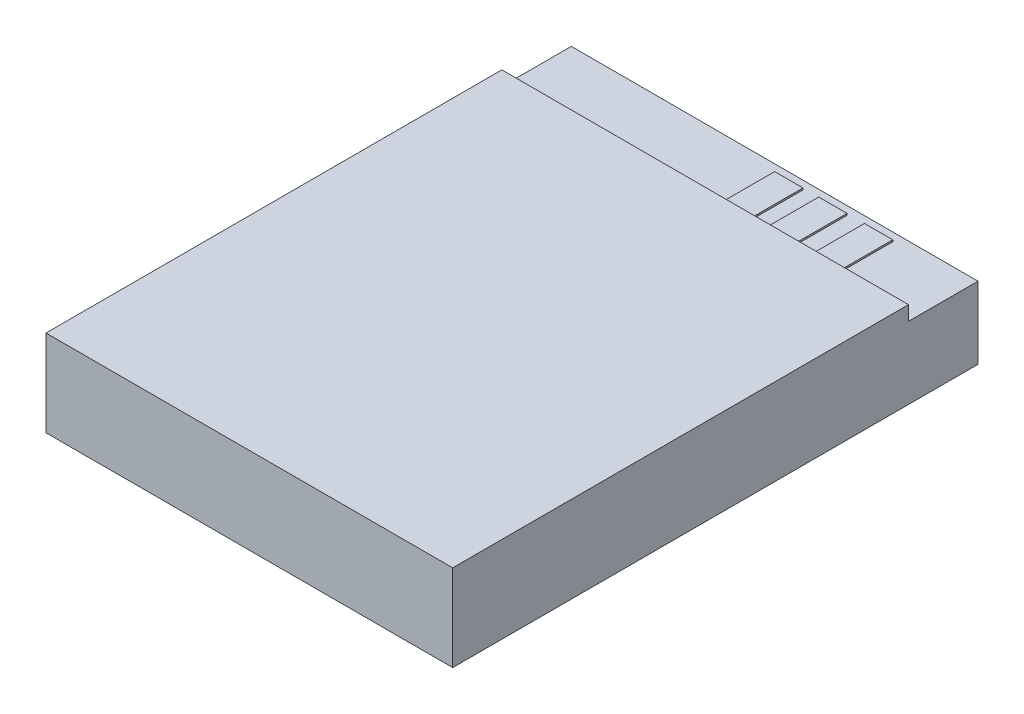
ISO-10303-21;
HEADER;
FILE_DESCRIPTION(('STEP AP214'),'2;1');
FILE_NAME('part.step','',(''),(''),'','','');
FILE_SCHEMA(('AUTOMOTIVE_DESIGN { 1 0 10303 214 1 1 1 1 }'));
ENDSEC;
DATA;
#1=APPLICATION_CONTEXT('core data for automotive mechanical design processes');
#2=APPLICATION_PROTOCOL_DEFINITION('international standard','automotive_design',2000,#1);
#3=PRODUCT_CONTEXT('',#1,'mechanical');
#4=PRODUCT('Part','Part','',(#3));
#5=PRODUCT_RELATED_PRODUCT_CATEGORY('part','',(#4));
#6=PRODUCT_DEFINITION_FORMATION('','',#4);
#7=PRODUCT_DEFINITION_CONTEXT('part definition',#1,'design');
#8=PRODUCT_DEFINITION('design','',#6,#7);
#9=PRODUCT_DEFINITION_SHAPE('','',#8);
#10=(LENGTH_UNIT() NAMED_UNIT(*) SI_UNIT(.MILLI.,.METRE.));
#11=(NAMED_UNIT(*) PLANE_ANGLE_UNIT() SI_UNIT($,.RADIAN.));
#12=(NAMED_UNIT(*) SI_UNIT($,.STERADIAN.) SOLID_ANGLE_UNIT());
#13=UNCERTAINTY_MEASURE_WITH_UNIT(LENGTH_MEASURE(1.E-05),#10,'distance_accuracy_value','');
#14=(GEOMETRIC_REPRESENTATION_CONTEXT(3) GLOBAL_UNCERTAINTY_ASSIGNED_CONTEXT((#13)) GLOBAL_UNIT_ASSIGNED_CONTEXT((#10,
#11,#12)) REPRESENTATION_CONTEXT('',''));
#15=CARTESIAN_POINT('',(0.,0.,0.));
#16=DIRECTION('',(0.,0.,1.));
#17=DIRECTION('',(1.,0.,0.));
#18=AXIS2_PLACEMENT_3D('',#15,#16,#17);
#19=CARTESIAN_POINT('',(0.,4.25,0.));
#20=DIRECTION('',(0.,1.,0.));
#21=DIRECTION('',(0.,0.,1.));
#22=AXIS2_PLACEMENT_3D('',#19,#20,#21);
#23=PLANE('',#22);
#24=DIRECTION('',(0.,0.,1.));
#25=VECTOR('',#24,1.);
#26=CARTESIAN_POINT('',(-12.,4.25,-15.5));
#27=LINE('',#26,#25);
#28=CARTESIAN_POINT('',(-12.,4.25,-15.5));
#29=VERTEX_POINT('',#28);
#30=CARTESIAN_POINT('',(-12.,4.25,-11.4));
#31=VERTEX_POINT('',#30);
#32=EDGE_CURVE('E248',#29,#31,#27,.T.);
#33=ORIENTED_EDGE('',*,*,#32,.T.);
#34=DIRECTION('',(1.,0.,0.));
#35=VECTOR('',#34,1.);
#36=CARTESIAN_POINT('',(-12.,4.25,-11.4));
#37=LINE('',#36,#35);
#38=CARTESIAN_POINT('',(12.,4.25,-11.4));
#39=VERTEX_POINT('',#38);
#40=EDGE_CURVE('E251',#31,#39,#37,.T.);
#41=ORIENTED_EDGE('',*,*,#40,.T.);
#42=DIRECTION('',(0.,0.,1.));
#43=VECTOR('',#42,1.);
#44=CARTESIAN_POINT('',(12.,4.25,-15.5));
#45=LINE('',#44,#43);
#46=CARTESIAN_POINT('',(12.,4.25,-15.5));
#47=VERTEX_POINT('',#46);
#48=EDGE_CURVE('E254',#47,#39,#45,.T.);
#49=ORIENTED_EDGE('',*,*,#48,.F.);
#50=DIRECTION('',(1.,0.,0.));
#51=VECTOR('',#50,1.);
#52=CARTESIAN_POINT('',(-12.,4.25,-15.5));
#53=LINE('',#52,#51);
#54=EDGE_CURVE('E257',#29,#47,#53,.T.);
#55=ORIENTED_EDGE('',*,*,#54,.F.);
#56=EDGE_LOOP('',(#33,#41,#49,#55));
#57=FACE_BOUND('',#56,.T.);
#58=DIRECTION('',(1.,0.,0.));
#59=VECTOR('',#58,1.);
#60=CARTESIAN_POINT('',(0.500000000000003,4.25,-12.));
#61=LINE('',#60,#59);
#62=CARTESIAN_POINT('',(0.500000000000003,4.25,-12.));
#63=VERTEX_POINT('',#62);
#64=CARTESIAN_POINT('',(2.17,4.25,-12.));
#65=VERTEX_POINT('',#64);
#66=EDGE_CURVE('E232',#63,#65,#61,.T.);
#67=ORIENTED_EDGE('',*,*,#66,.F.);
#68=DIRECTION('',(0.,0.,1.));
#69=VECTOR('',#68,1.);
#70=CARTESIAN_POINT('',(0.500000000000002,4.25,-15.));
#71=LINE('',#70,#69);
#72=CARTESIAN_POINT('',(0.500000000000002,4.25,-15.));
#73=VERTEX_POINT('',#72);
#74=EDGE_CURVE('E218',#73,#63,#71,.T.);
#75=ORIENTED_EDGE('',*,*,#74,.F.);
#76=DIRECTION('',(-1.,0.,0.));
#77=VECTOR('',#76,1.);
#78=CARTESIAN_POINT('',(0.500000000000002,4.25,-15.));
#79=LINE('',#78,#77);
#80=CARTESIAN_POINT('',(2.17,4.25,-15.));
#81=VERTEX_POINT('',#80);
#82=EDGE_CURVE('E223',#81,#73,#79,.T.);
#83=ORIENTED_EDGE('',*,*,#82,.F.);
#84=DIRECTION('',(0.,0.,-1.));
#85=VECTOR('',#84,1.);
#86=CARTESIAN_POINT('',(2.17,4.25,-15.));
#87=LINE('',#86,#85);
#88=EDGE_CURVE('E234',#65,#81,#87,.T.);
#89=ORIENTED_EDGE('',*,*,#88,.F.);
#90=EDGE_LOOP('',(#67,#75,#83,#89));
#91=FACE_BOUND('',#90,.T.);
#92=DIRECTION('',(1.,0.,0.));
#93=VECTOR('',#92,1.);
#94=CARTESIAN_POINT('',(3.1,4.25,-12.));
#95=LINE('',#94,#93);
#96=CARTESIAN_POINT('',(3.1,4.25,-12.));
#97=VERTEX_POINT('',#96);
#98=CARTESIAN_POINT('',(4.77,4.25,-12.));
#99=VERTEX_POINT('',#98);
#100=EDGE_CURVE('E190',#97,#99,#95,.T.);
#101=ORIENTED_EDGE('',*,*,#100,.F.);
#102=DIRECTION('',(0.,0.,1.));
#103=VECTOR('',#102,1.);
#104=CARTESIAN_POINT('',(3.1,4.25,-15.));
#105=LINE('',#104,#103);
#106=CARTESIAN_POINT('',(3.1,4.25,-15.));
#107=VERTEX_POINT('',#106);
#108=EDGE_CURVE('E187',#107,#97,#105,.T.);
#109=ORIENTED_EDGE('',*,*,#108,.F.);
#110=DIRECTION('',(-1.,0.,0.));
#111=VECTOR('',#110,1.);
#112=CARTESIAN_POINT('',(3.1,4.25,-15.));
#113=LINE('',#112,#111);
#114=CARTESIAN_POINT('',(4.77,4.25,-15.));
#115=VERTEX_POINT('',#114);
#116=EDGE_CURVE('E199',#115,#107,#113,.T.);
#117=ORIENTED_EDGE('',*,*,#116,.F.);
#118=DIRECTION('',(0.,0.,-1.));
#119=VECTOR('',#118,1.);
#120=CARTESIAN_POINT('',(4.77,4.25,-15.));
#121=LINE('',#120,#119);
#122=EDGE_CURVE('E207',#99,#115,#121,.T.);
#123=ORIENTED_EDGE('',*,*,#122,.F.);
#124=EDGE_LOOP('',(#101,#109,#117,#123));
#125=FACE_BOUND('',#124,.T.);
#126=DIRECTION('',(1.,0.,0.));
#127=VECTOR('',#126,1.);
#128=CARTESIAN_POINT('',(5.8,4.25,-12.));
#129=LINE('',#128,#127);
#130=CARTESIAN_POINT('',(5.8,4.25,-12.));
#131=VERTEX_POINT('',#130);
#132=CARTESIAN_POINT('',(7.47,4.25,-12.));
#133=VERTEX_POINT('',#132);
#134=EDGE_CURVE('E328',#131,#133,#129,.T.);
#135=ORIENTED_EDGE('',*,*,#134,.F.);
#136=DIRECTION('',(0.,0.,1.));
#137=VECTOR('',#136,1.);
#138=CARTESIAN_POINT('',(5.8,4.25,-15.));
#139=LINE('',#138,#137);
#140=CARTESIAN_POINT('',(5.8,4.25,-15.));
#141=VERTEX_POINT('',#140);
#142=EDGE_CURVE('E185',#141,#131,#139,.T.);
#143=ORIENTED_EDGE('',*,*,#142,.F.);
#144=DIRECTION('',(-1.,0.,0.));
#145=VECTOR('',#144,1.);
#146=CARTESIAN_POINT('',(5.8,4.25,-15.));
#147=LINE('',#146,#145);
#148=CARTESIAN_POINT('',(7.47,4.25,-15.));
#149=VERTEX_POINT('',#148);
#150=EDGE_CURVE('E181',#149,#141,#147,.T.);
#151=ORIENTED_EDGE('',*,*,#150,.F.);
#152=DIRECTION('',(0.,0.,-1.));
#153=VECTOR('',#152,1.);
#154=CARTESIAN_POINT('',(7.47,4.25,-15.));
#155=LINE('',#154,#153);
#156=EDGE_CURVE('E330',#133,#149,#155,.T.);
#157=ORIENTED_EDGE('',*,*,#156,.F.);
#158=EDGE_LOOP('',(#135,#143,#151,#157));
#159=FACE_BOUND('',#158,.T.);
#160=ADVANCED_FACE('F37',(#57,#91,#125,#159),#23,.T.);
#161=CARTESIAN_POINT('',(-12.,5.1,-15.5));
#162=DIRECTION('',(0.,0.,1.));
#163=DIRECTION('',(1.,0.,0.));
#164=AXIS2_PLACEMENT_3D('',#161,#162,#163);
#165=PLANE('',#164);
#166=ORIENTED_EDGE('',*,*,#54,.T.);
#167=DIRECTION('',(0.,-1.,0.));
#168=VECTOR('',#167,1.);
#169=CARTESIAN_POINT('',(12.,5.1,-15.5));
#170=LINE('',#169,#168);
#171=CARTESIAN_POINT('',(12.,0.,-15.5));
#172=VERTEX_POINT('',#171);
#173=EDGE_CURVE('E11',#47,#172,#170,.T.);
#174=ORIENTED_EDGE('',*,*,#173,.T.);
#175=DIRECTION('',(-1.,0.,0.));
#176=VECTOR('',#175,1.);
#177=CARTESIAN_POINT('',(-12.,0.,-15.5));
#178=LINE('',#177,#176);
#179=CARTESIAN_POINT('',(-12.,0.,-15.5));
#180=VERTEX_POINT('',#179);
#181=EDGE_CURVE('E278',#172,#180,#178,.T.);
#182=ORIENTED_EDGE('',*,*,#181,.T.);
#183=DIRECTION('',(0.,-1.,0.));
#184=VECTOR('',#183,1.);
#185=CARTESIAN_POINT('',(-12.,5.1,-15.5));
#186=LINE('',#185,#184);
#187=EDGE_CURVE('E45',#29,#180,#186,.T.);
#188=ORIENTED_EDGE('',*,*,#187,.F.);
#189=EDGE_LOOP('',(#166,#174,#182,#188));
#190=FACE_BOUND('',#189,.T.);
#191=ADVANCED_FACE('F298',(#190),#165,.F.);
#192=CARTESIAN_POINT('',(12.,5.1,15.5));
#193=DIRECTION('',(-1.,0.,0.));
#194=DIRECTION('',(0.,0.,1.));
#195=AXIS2_PLACEMENT_3D('',#192,#193,#194);
#196=PLANE('',#195);
#197=ORIENTED_EDGE('',*,*,#48,.T.);
#198=DIRECTION('',(0.,1.,0.));
#199=VECTOR('',#198,1.);
#200=CARTESIAN_POINT('',(12.,4.25,-11.4));
#201=LINE('',#200,#199);
#202=CARTESIAN_POINT('',(12.,5.1,-11.4));
#203=VERTEX_POINT('',#202);
#204=EDGE_CURVE('E262',#39,#203,#201,.T.);
#205=ORIENTED_EDGE('',*,*,#204,.T.);
#206=DIRECTION('',(0.,0.,-1.));
#207=VECTOR('',#206,1.);
#208=CARTESIAN_POINT('',(12.,5.1,15.5));
#209=LINE('',#208,#207);
#210=CARTESIAN_POINT('',(12.,5.1,15.5));
#211=VERTEX_POINT('',#210);
#212=EDGE_CURVE('E267',#211,#203,#209,.T.);
#213=ORIENTED_EDGE('',*,*,#212,.F.);
#214=DIRECTION('',(0.,-1.,0.));
#215=VECTOR('',#214,1.);
#216=CARTESIAN_POINT('',(12.,5.1,15.5));
#217=LINE('',#216,#215);
#218=CARTESIAN_POINT('',(12.,0.,15.5));
#219=VERTEX_POINT('',#218);
#220=EDGE_CURVE('E275',#211,#219,#217,.T.);
#221=ORIENTED_EDGE('',*,*,#220,.T.);
#222=DIRECTION('',(0.,0.,-1.));
#223=VECTOR('',#222,1.);
#224=CARTESIAN_POINT('',(12.,0.,15.5));
#225=LINE('',#224,#223);
#226=EDGE_CURVE('E265',#219,#172,#225,.T.);
#227=ORIENTED_EDGE('',*,*,#226,.T.);
#228=ORIENTED_EDGE('',*,*,#173,.F.);
#229=EDGE_LOOP('',(#197,#205,#213,#221,#227,#228));
#230=FACE_BOUND('',#229,.T.);
#231=ADVANCED_FACE('F39',(#230),#196,.F.);
#232=CARTESIAN_POINT('',(-12.,5.1,15.5));
#233=DIRECTION('',(1.,0.,0.));
#234=DIRECTION('',(0.,0.,-1.));
#235=AXIS2_PLACEMENT_3D('',#232,#233,#234);
#236=PLANE('',#235);
#237=DIRECTION('',(0.,0.,1.));
#238=VECTOR('',#237,1.);
#239=CARTESIAN_POINT('',(-12.,5.1,15.5));
#240=LINE('',#239,#238);
#241=CARTESIAN_POINT('',(-12.,5.1,-11.4));
#242=VERTEX_POINT('',#241);
#243=CARTESIAN_POINT('',(-12.,5.1,15.5));
#244=VERTEX_POINT('',#243);
#245=EDGE_CURVE('E270',#242,#244,#240,.T.);
#246=ORIENTED_EDGE('',*,*,#245,.F.);
#247=DIRECTION('',(0.,1.,0.));
#248=VECTOR('',#247,1.);
#249=CARTESIAN_POINT('',(-12.,4.25,-11.4));
#250=LINE('',#249,#248);
#251=EDGE_CURVE('E260',#31,#242,#250,.T.);
#252=ORIENTED_EDGE('',*,*,#251,.F.);
#253=ORIENTED_EDGE('',*,*,#32,.F.);
#254=ORIENTED_EDGE('',*,*,#187,.T.);
#255=DIRECTION('',(0.,0.,1.));
#256=VECTOR('',#255,1.);
#257=CARTESIAN_POINT('',(-12.,0.,15.5));
#258=LINE('',#257,#256);
#259=CARTESIAN_POINT('',(-12.,0.,15.5));
#260=VERTEX_POINT('',#259);
#261=EDGE_CURVE('E281',#180,#260,#258,.T.);
#262=ORIENTED_EDGE('',*,*,#261,.T.);
#263=DIRECTION('',(0.,-1.,0.));
#264=VECTOR('',#263,1.);
#265=CARTESIAN_POINT('',(-12.,5.1,15.5));
#266=LINE('',#265,#264);
#267=EDGE_CURVE('E286',#244,#260,#266,.T.);
#268=ORIENTED_EDGE('',*,*,#267,.F.);
#269=EDGE_LOOP('',(#246,#252,#253,#254,#262,#268));
#270=FACE_BOUND('',#269,.T.);
#271=ADVANCED_FACE('F292',(#270),#236,.F.);
#272=CARTESIAN_POINT('',(-12.,5.1,15.5));
#273=DIRECTION('',(0.,0.,-1.));
#274=DIRECTION('',(-1.,0.,0.));
#275=AXIS2_PLACEMENT_3D('',#272,#273,#274);
#276=PLANE('',#275);
#277=DIRECTION('',(1.,0.,0.));
#278=VECTOR('',#277,1.);
#279=CARTESIAN_POINT('',(-12.,0.,15.5));
#280=LINE('',#279,#278);
#281=EDGE_CURVE('E271',#260,#219,#280,.T.);
#282=ORIENTED_EDGE('',*,*,#281,.T.);
#283=ORIENTED_EDGE('',*,*,#220,.F.);
#284=DIRECTION('',(1.,0.,0.));
#285=VECTOR('',#284,1.);
#286=CARTESIAN_POINT('',(-12.,5.1,15.5));
#287=LINE('',#286,#285);
#288=EDGE_CURVE('E273',#244,#211,#287,.T.);
#289=ORIENTED_EDGE('',*,*,#288,.F.);
#290=ORIENTED_EDGE('',*,*,#267,.T.);
#291=EDGE_LOOP('',(#282,#283,#289,#290));
#292=FACE_BOUND('',#291,.T.);
#293=ADVANCED_FACE('F306',(#292),#276,.F.);
#294=CARTESIAN_POINT('',(0.,5.1,0.));
#295=DIRECTION('',(0.,-1.,0.));
#296=DIRECTION('',(0.,0.,-1.));
#297=AXIS2_PLACEMENT_3D('',#294,#295,#296);
#298=PLANE('',#297);
#299=ORIENTED_EDGE('',*,*,#212,.T.);
#300=DIRECTION('',(1.,0.,0.));
#301=VECTOR('',#300,1.);
#302=CARTESIAN_POINT('',(-12.,5.1,-11.4));
#303=LINE('',#302,#301);
#304=EDGE_CURVE('E247',#242,#203,#303,.T.);
#305=ORIENTED_EDGE('',*,*,#304,.F.);
#306=ORIENTED_EDGE('',*,*,#245,.T.);
#307=ORIENTED_EDGE('',*,*,#288,.T.);
#308=EDGE_LOOP('',(#299,#305,#306,#307));
#309=FACE_BOUND('',#308,.T.);
#310=ADVANCED_FACE('F312',(#309),#298,.F.);
#311=CARTESIAN_POINT('',(0.,0.,0.));
#312=DIRECTION('',(0.,-1.,0.));
#313=DIRECTION('',(0.,0.,-1.));
#314=AXIS2_PLACEMENT_3D('',#311,#312,#313);
#315=PLANE('',#314);
#316=ORIENTED_EDGE('',*,*,#226,.F.);
#317=ORIENTED_EDGE('',*,*,#281,.F.);
#318=ORIENTED_EDGE('',*,*,#261,.F.);
#319=ORIENTED_EDGE('',*,*,#181,.F.);
#320=EDGE_LOOP('',(#316,#317,#318,#319));
#321=FACE_BOUND('',#320,.T.);
#322=ADVANCED_FACE('F303',(#321),#315,.T.);
#323=CARTESIAN_POINT('',(-12.,4.25,-11.4));
#324=DIRECTION('',(0.,0.,1.));
#325=DIRECTION('',(1.,0.,0.));
#326=AXIS2_PLACEMENT_3D('',#323,#324,#325);
#327=PLANE('',#326);
#328=ORIENTED_EDGE('',*,*,#304,.T.);
#329=ORIENTED_EDGE('',*,*,#204,.F.);
#330=ORIENTED_EDGE('',*,*,#40,.F.);
#331=ORIENTED_EDGE('',*,*,#251,.T.);
#332=EDGE_LOOP('',(#328,#329,#330,#331));
#333=FACE_BOUND('',#332,.T.);
#334=ADVANCED_FACE('F314',(#333),#327,.F.);
#335=CARTESIAN_POINT('',(0.500000000000002,4.35,-15.));
#336=DIRECTION('',(1.,0.,0.));
#337=DIRECTION('',(0.,0.,-1.));
#338=AXIS2_PLACEMENT_3D('',#335,#336,#337);
#339=PLANE('',#338);
#340=ORIENTED_EDGE('',*,*,#74,.T.);
#341=DIRECTION('',(0.,-1.,0.));
#342=VECTOR('',#341,1.);
#343=CARTESIAN_POINT('',(0.500000000000003,4.35,-12.));
#344=LINE('',#343,#342);
#345=CARTESIAN_POINT('',(0.500000000000003,4.35,-12.));
#346=VERTEX_POINT('',#345);
#347=EDGE_CURVE('E245',#346,#63,#344,.T.);
#348=ORIENTED_EDGE('',*,*,#347,.F.);
#349=DIRECTION('',(0.,0.,1.));
#350=VECTOR('',#349,1.);
#351=CARTESIAN_POINT('',(0.500000000000002,4.35,-15.));
#352=LINE('',#351,#350);
#353=CARTESIAN_POINT('',(0.500000000000002,4.35,-15.));
#354=VERTEX_POINT('',#353);
#355=EDGE_CURVE('E219',#354,#346,#352,.T.);
#356=ORIENTED_EDGE('',*,*,#355,.F.);
#357=DIRECTION('',(0.,-1.,0.));
#358=VECTOR('',#357,1.);
#359=CARTESIAN_POINT('',(0.500000000000002,4.35,-15.));
#360=LINE('',#359,#358);
#361=EDGE_CURVE('E229',#354,#73,#360,.T.);
#362=ORIENTED_EDGE('',*,*,#361,.T.);
#363=EDGE_LOOP('',(#340,#348,#356,#362));
#364=FACE_BOUND('',#363,.T.);
#365=ADVANCED_FACE('F389',(#364),#339,.F.);
#366=CARTESIAN_POINT('',(0.500000000000003,4.35,-12.));
#367=DIRECTION('',(0.,0.,-1.));
#368=DIRECTION('',(-1.,0.,0.));
#369=AXIS2_PLACEMENT_3D('',#366,#367,#368);
#370=PLANE('',#369);
#371=ORIENTED_EDGE('',*,*,#66,.T.);
#372=DIRECTION('',(0.,-1.,0.));
#373=VECTOR('',#372,1.);
#374=CARTESIAN_POINT('',(2.17,4.35,-12.));
#375=LINE('',#374,#373);
#376=CARTESIAN_POINT('',(2.17,4.35,-12.));
#377=VERTEX_POINT('',#376);
#378=EDGE_CURVE('E242',#377,#65,#375,.T.);
#379=ORIENTED_EDGE('',*,*,#378,.F.);
#380=DIRECTION('',(1.,0.,0.));
#381=VECTOR('',#380,1.);
#382=CARTESIAN_POINT('',(0.500000000000003,4.35,-12.));
#383=LINE('',#382,#381);
#384=EDGE_CURVE('E222',#346,#377,#383,.T.);
#385=ORIENTED_EDGE('',*,*,#384,.F.);
#386=ORIENTED_EDGE('',*,*,#347,.T.);
#387=EDGE_LOOP('',(#371,#379,#385,#386));
#388=FACE_BOUND('',#387,.T.);
#389=ADVANCED_FACE('F385',(#388),#370,.F.);
#390=CARTESIAN_POINT('',(2.17,4.35,-15.));
#391=DIRECTION('',(-1.,0.,0.));
#392=DIRECTION('',(0.,0.,1.));
#393=AXIS2_PLACEMENT_3D('',#390,#391,#392);
#394=PLANE('',#393);
#395=ORIENTED_EDGE('',*,*,#88,.T.);
#396=DIRECTION('',(0.,-1.,0.));
#397=VECTOR('',#396,1.);
#398=CARTESIAN_POINT('',(2.17,4.35,-15.));
#399=LINE('',#398,#397);
#400=CARTESIAN_POINT('',(2.17,4.35,-15.));
#401=VERTEX_POINT('',#400);
#402=EDGE_CURVE('E240',#401,#81,#399,.T.);
#403=ORIENTED_EDGE('',*,*,#402,.F.);
#404=DIRECTION('',(0.,0.,-1.));
#405=VECTOR('',#404,1.);
#406=CARTESIAN_POINT('',(2.17,4.35,-15.));
#407=LINE('',#406,#405);
#408=EDGE_CURVE('E225',#377,#401,#407,.T.);
#409=ORIENTED_EDGE('',*,*,#408,.F.);
#410=ORIENTED_EDGE('',*,*,#378,.T.);
#411=EDGE_LOOP('',(#395,#403,#409,#410));
#412=FACE_BOUND('',#411,.T.);
#413=ADVANCED_FACE('F381',(#412),#394,.F.);
#414=CARTESIAN_POINT('',(0.500000000000002,4.35,-15.));
#415=DIRECTION('',(0.,0.,1.));
#416=DIRECTION('',(1.,0.,0.));
#417=AXIS2_PLACEMENT_3D('',#414,#415,#416);
#418=PLANE('',#417);
#419=ORIENTED_EDGE('',*,*,#82,.T.);
#420=ORIENTED_EDGE('',*,*,#361,.F.);
#421=DIRECTION('',(-1.,0.,0.));
#422=VECTOR('',#421,1.);
#423=CARTESIAN_POINT('',(0.500000000000002,4.35,-15.));
#424=LINE('',#423,#422);
#425=EDGE_CURVE('E227',#401,#354,#424,.T.);
#426=ORIENTED_EDGE('',*,*,#425,.F.);
#427=ORIENTED_EDGE('',*,*,#402,.T.);
#428=EDGE_LOOP('',(#419,#420,#426,#427));
#429=FACE_BOUND('',#428,.T.);
#430=ADVANCED_FACE('F377',(#429),#418,.F.);
#431=CARTESIAN_POINT('',(0.,4.35,0.));
#432=DIRECTION('',(0.,1.,0.));
#433=DIRECTION('',(0.,0.,1.));
#434=AXIS2_PLACEMENT_3D('',#431,#432,#433);
#435=PLANE('',#434);
#436=ORIENTED_EDGE('',*,*,#355,.T.);
#437=ORIENTED_EDGE('',*,*,#384,.T.);
#438=ORIENTED_EDGE('',*,*,#408,.T.);
#439=ORIENTED_EDGE('',*,*,#425,.T.);
#440=EDGE_LOOP('',(#436,#437,#438,#439));
#441=FACE_BOUND('',#440,.T.);
#442=ADVANCED_FACE('F373',(#441),#435,.T.);
#443=CARTESIAN_POINT('',(3.1,4.35,-15.));
#444=DIRECTION('',(1.,0.,0.));
#445=DIRECTION('',(0.,0.,-1.));
#446=AXIS2_PLACEMENT_3D('',#443,#444,#445);
#447=PLANE('',#446);
#448=ORIENTED_EDGE('',*,*,#108,.T.);
#449=DIRECTION('',(0.,-1.,0.));
#450=VECTOR('',#449,1.);
#451=CARTESIAN_POINT('',(3.1,4.35,-12.));
#452=LINE('',#451,#450);
#453=CARTESIAN_POINT('',(3.1,4.35,-12.));
#454=VERTEX_POINT('',#453);
#455=EDGE_CURVE('E216',#454,#97,#452,.T.);
#456=ORIENTED_EDGE('',*,*,#455,.F.);
#457=DIRECTION('',(0.,0.,1.));
#458=VECTOR('',#457,1.);
#459=CARTESIAN_POINT('',(3.1,4.35,-15.));
#460=LINE('',#459,#458);
#461=CARTESIAN_POINT('',(3.1,4.35,-15.));
#462=VERTEX_POINT('',#461);
#463=EDGE_CURVE('E195',#462,#454,#460,.T.);
#464=ORIENTED_EDGE('',*,*,#463,.F.);
#465=DIRECTION('',(0.,-1.,0.));
#466=VECTOR('',#465,1.);
#467=CARTESIAN_POINT('',(3.1,4.35,-15.));
#468=LINE('',#467,#466);
#469=EDGE_CURVE('E204',#462,#107,#468,.T.);
#470=ORIENTED_EDGE('',*,*,#469,.T.);
#471=EDGE_LOOP('',(#448,#456,#464,#470));
#472=FACE_BOUND('',#471,.T.);
#473=ADVANCED_FACE('F369',(#472),#447,.F.);
#474=CARTESIAN_POINT('',(3.1,4.35,-12.));
#475=DIRECTION('',(0.,0.,-1.));
#476=DIRECTION('',(-1.,0.,0.));
#477=AXIS2_PLACEMENT_3D('',#474,#475,#476);
#478=PLANE('',#477);
#479=ORIENTED_EDGE('',*,*,#100,.T.);
#480=DIRECTION('',(0.,-1.,0.));
#481=VECTOR('',#480,1.);
#482=CARTESIAN_POINT('',(4.77,4.35,-12.));
#483=LINE('',#482,#481);
#484=CARTESIAN_POINT('',(4.77,4.35,-12.));
#485=VERTEX_POINT('',#484);
#486=EDGE_CURVE('E213',#485,#99,#483,.T.);
#487=ORIENTED_EDGE('',*,*,#486,.F.);
#488=DIRECTION('',(1.,0.,0.));
#489=VECTOR('',#488,1.);
#490=CARTESIAN_POINT('',(3.1,4.35,-12.));
#491=LINE('',#490,#489);
#492=EDGE_CURVE('E198',#454,#485,#491,.T.);
#493=ORIENTED_EDGE('',*,*,#492,.F.);
#494=ORIENTED_EDGE('',*,*,#455,.T.);
#495=EDGE_LOOP('',(#479,#487,#493,#494));
#496=FACE_BOUND('',#495,.T.);
#497=ADVANCED_FACE('F365',(#496),#478,.F.);
#498=CARTESIAN_POINT('',(4.77,4.35,-15.));
#499=DIRECTION('',(-1.,0.,0.));
#500=DIRECTION('',(0.,0.,1.));
#501=AXIS2_PLACEMENT_3D('',#498,#499,#500);
#502=PLANE('',#501);
#503=ORIENTED_EDGE('',*,*,#122,.T.);
#504=DIRECTION('',(0.,-1.,0.));
#505=VECTOR('',#504,1.);
#506=CARTESIAN_POINT('',(4.77,4.35,-15.));
#507=LINE('',#506,#505);
#508=CARTESIAN_POINT('',(4.77,4.35,-15.));
#509=VERTEX_POINT('',#508);
#510=EDGE_CURVE('E60',#509,#115,#507,.T.);
#511=ORIENTED_EDGE('',*,*,#510,.F.);
#512=DIRECTION('',(0.,0.,-1.));
#513=VECTOR('',#512,1.);
#514=CARTESIAN_POINT('',(4.77,4.35,-15.));
#515=LINE('',#514,#513);
#516=EDGE_CURVE('E201',#485,#509,#515,.T.);
#517=ORIENTED_EDGE('',*,*,#516,.F.);
#518=ORIENTED_EDGE('',*,*,#486,.T.);
#519=EDGE_LOOP('',(#503,#511,#517,#518));
#520=FACE_BOUND('',#519,.T.);
#521=ADVANCED_FACE('F362',(#520),#502,.F.);
#522=CARTESIAN_POINT('',(3.1,4.35,-15.));
#523=DIRECTION('',(0.,0.,1.));
#524=DIRECTION('',(1.,0.,0.));
#525=AXIS2_PLACEMENT_3D('',#522,#523,#524);
#526=PLANE('',#525);
#527=ORIENTED_EDGE('',*,*,#116,.T.);
#528=ORIENTED_EDGE('',*,*,#469,.F.);
#529=DIRECTION('',(-1.,0.,0.));
#530=VECTOR('',#529,1.);
#531=CARTESIAN_POINT('',(3.1,4.35,-15.));
#532=LINE('',#531,#530);
#533=EDGE_CURVE('E203',#509,#462,#532,.T.);
#534=ORIENTED_EDGE('',*,*,#533,.F.);
#535=ORIENTED_EDGE('',*,*,#510,.T.);
#536=EDGE_LOOP('',(#527,#528,#534,#535));
#537=FACE_BOUND('',#536,.T.);
#538=ADVANCED_FACE('F358',(#537),#526,.F.);
#539=CARTESIAN_POINT('',(0.,4.35,0.));
#540=DIRECTION('',(0.,1.,0.));
#541=DIRECTION('',(0.,0.,1.));
#542=AXIS2_PLACEMENT_3D('',#539,#540,#541);
#543=PLANE('',#542);
#544=ORIENTED_EDGE('',*,*,#463,.T.);
#545=ORIENTED_EDGE('',*,*,#492,.T.);
#546=ORIENTED_EDGE('',*,*,#516,.T.);
#547=ORIENTED_EDGE('',*,*,#533,.T.);
#548=EDGE_LOOP('',(#544,#545,#546,#547));
#549=FACE_BOUND('',#548,.T.);
#550=ADVANCED_FACE('F355',(#549),#543,.T.);
#551=CARTESIAN_POINT('',(5.8,4.35,-15.));
#552=DIRECTION('',(1.,0.,0.));
#553=DIRECTION('',(0.,0.,-1.));
#554=AXIS2_PLACEMENT_3D('',#551,#552,#553);
#555=PLANE('',#554);
#556=ORIENTED_EDGE('',*,*,#142,.T.);
#557=DIRECTION('',(0.,-1.,0.));
#558=VECTOR('',#557,1.);
#559=CARTESIAN_POINT('',(5.8,4.35,-12.));
#560=LINE('',#559,#558);
#561=CARTESIAN_POINT('',(5.8,4.35,-12.));
#562=VERTEX_POINT('',#561);
#563=EDGE_CURVE('E166',#562,#131,#560,.T.);
#564=ORIENTED_EDGE('',*,*,#563,.F.);
#565=DIRECTION('',(0.,0.,1.));
#566=VECTOR('',#565,1.);
#567=CARTESIAN_POINT('',(5.8,4.35,-15.));
#568=LINE('',#567,#566);
#569=CARTESIAN_POINT('',(5.8,4.35,-15.));
#570=VERTEX_POINT('',#569);
#571=EDGE_CURVE('E173',#570,#562,#568,.T.);
#572=ORIENTED_EDGE('',*,*,#571,.F.);
#573=DIRECTION('',(0.,-1.,0.));
#574=VECTOR('',#573,1.);
#575=CARTESIAN_POINT('',(5.8,4.35,-15.));
#576=LINE('',#575,#574);
#577=EDGE_CURVE('E337',#570,#141,#576,.T.);
#578=ORIENTED_EDGE('',*,*,#577,.T.);
#579=EDGE_LOOP('',(#556,#564,#572,#578));
#580=FACE_BOUND('',#579,.T.);
#581=ADVANCED_FACE('F183',(#580),#555,.F.);
#582=CARTESIAN_POINT('',(5.8,4.35,-12.));
#583=DIRECTION('',(0.,0.,-1.));
#584=DIRECTION('',(-1.,0.,0.));
#585=AXIS2_PLACEMENT_3D('',#582,#583,#584);
#586=PLANE('',#585);
#587=ORIENTED_EDGE('',*,*,#134,.T.);
#588=DIRECTION('',(0.,-1.,0.));
#589=VECTOR('',#588,1.);
#590=CARTESIAN_POINT('',(7.47,4.35,-12.));
#591=LINE('',#590,#589);
#592=CARTESIAN_POINT('',(7.47,4.35,-12.));
#593=VERTEX_POINT('',#592);
#594=EDGE_CURVE('E169',#593,#133,#591,.T.);
#595=ORIENTED_EDGE('',*,*,#594,.F.);
#596=DIRECTION('',(1.,0.,0.));
#597=VECTOR('',#596,1.);
#598=CARTESIAN_POINT('',(5.8,4.35,-12.));
#599=LINE('',#598,#597);
#600=EDGE_CURVE('E162',#562,#593,#599,.T.);
#601=ORIENTED_EDGE('',*,*,#600,.F.);
#602=ORIENTED_EDGE('',*,*,#563,.T.);
#603=EDGE_LOOP('',(#587,#595,#601,#602));
#604=FACE_BOUND('',#603,.T.);
#605=ADVANCED_FACE('F164',(#604),#586,.F.);
#606=CARTESIAN_POINT('',(7.47,4.35,-15.));
#607=DIRECTION('',(-1.,0.,0.));
#608=DIRECTION('',(0.,0.,1.));
#609=AXIS2_PLACEMENT_3D('',#606,#607,#608);
#610=PLANE('',#609);
#611=ORIENTED_EDGE('',*,*,#156,.T.);
#612=DIRECTION('',(0.,-1.,0.));
#613=VECTOR('',#612,1.);
#614=CARTESIAN_POINT('',(7.47,4.35,-15.));
#615=LINE('',#614,#613);
#616=CARTESIAN_POINT('',(7.47,4.35,-15.));
#617=VERTEX_POINT('',#616);
#618=EDGE_CURVE('E52',#617,#149,#615,.T.);
#619=ORIENTED_EDGE('',*,*,#618,.F.);
#620=DIRECTION('',(0.,0.,-1.));
#621=VECTOR('',#620,1.);
#622=CARTESIAN_POINT('',(7.47,4.35,-15.));
#623=LINE('',#622,#621);
#624=EDGE_CURVE('E172',#593,#617,#623,.T.);
#625=ORIENTED_EDGE('',*,*,#624,.F.);
#626=ORIENTED_EDGE('',*,*,#594,.T.);
#627=EDGE_LOOP('',(#611,#619,#625,#626));
#628=FACE_BOUND('',#627,.T.);
#629=ADVANCED_FACE('F340',(#628),#610,.F.);
#630=CARTESIAN_POINT('',(5.8,4.35,-15.));
#631=DIRECTION('',(0.,0.,1.));
#632=DIRECTION('',(1.,0.,0.));
#633=AXIS2_PLACEMENT_3D('',#630,#631,#632);
#634=PLANE('',#633);
#635=ORIENTED_EDGE('',*,*,#150,.T.);
#636=ORIENTED_EDGE('',*,*,#577,.F.);
#637=DIRECTION('',(-1.,0.,0.));
#638=VECTOR('',#637,1.);
#639=CARTESIAN_POINT('',(5.8,4.35,-15.));
#640=LINE('',#639,#638);
#641=EDGE_CURVE('E177',#617,#570,#640,.T.);
#642=ORIENTED_EDGE('',*,*,#641,.F.);
#643=ORIENTED_EDGE('',*,*,#618,.T.);
#644=EDGE_LOOP('',(#635,#636,#642,#643));
#645=FACE_BOUND('',#644,.T.);
#646=ADVANCED_FACE('F341',(#645),#634,.F.);
#647=CARTESIAN_POINT('',(0.,4.35,0.));
#648=DIRECTION('',(0.,1.,0.));
#649=DIRECTION('',(0.,0.,1.));
#650=AXIS2_PLACEMENT_3D('',#647,#648,#649);
#651=PLANE('',#650);
#652=ORIENTED_EDGE('',*,*,#571,.T.);
#653=ORIENTED_EDGE('',*,*,#600,.T.);
#654=ORIENTED_EDGE('',*,*,#624,.T.);
#655=ORIENTED_EDGE('',*,*,#641,.T.);
#656=EDGE_LOOP('',(#652,#653,#654,#655));
#657=FACE_BOUND('',#656,.T.);
#658=ADVANCED_FACE('F176',(#657),#651,.T.);
#659=CLOSED_SHELL('',(#160,#191,#231,#271,#293,#310,#322,#334,#365,#389,#413,#430,#442,#473,
#497,#521,#538,#550,#581,#605,#629,#646,#658));
#660=MANIFOLD_SOLID_BREP('B2',#659);
#661=ADVANCED_BREP_SHAPE_REPRESENTATION('',(#18,#660),#14);
#662=SHAPE_DEFINITION_REPRESENTATION(#9,#661);
ENDSEC;
END-ISO-10303-21;
